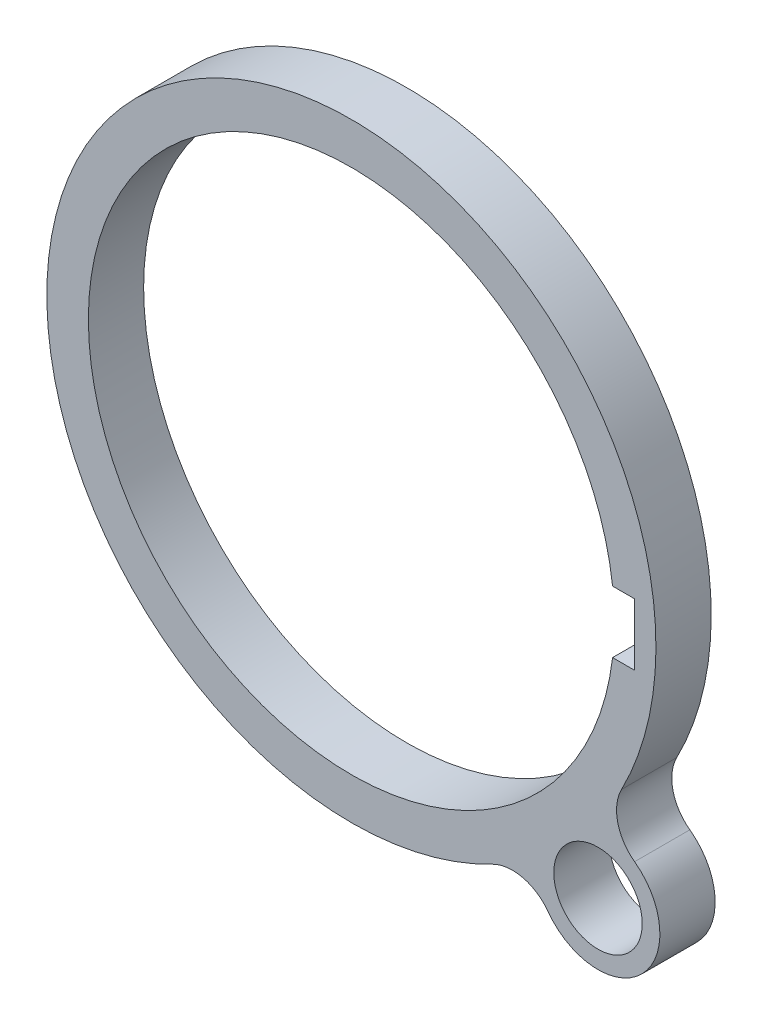
ISO-10303-21;
HEADER;
FILE_DESCRIPTION(('STEP AP214'),'2;1');
FILE_NAME('part.step','',(''),(''),'','','');
FILE_SCHEMA(('AUTOMOTIVE_DESIGN { 1 0 10303 214 1 1 1 1 }'));
ENDSEC;
DATA;
#1=APPLICATION_CONTEXT('core data for automotive mechanical design processes');
#2=APPLICATION_PROTOCOL_DEFINITION('international standard','automotive_design',2000,#1);
#3=PRODUCT_CONTEXT('',#1,'mechanical');
#4=PRODUCT('Part','Part','',(#3));
#5=PRODUCT_RELATED_PRODUCT_CATEGORY('part','',(#4));
#6=PRODUCT_DEFINITION_FORMATION('','',#4);
#7=PRODUCT_DEFINITION_CONTEXT('part definition',#1,'design');
#8=PRODUCT_DEFINITION('design','',#6,#7);
#9=PRODUCT_DEFINITION_SHAPE('','',#8);
#10=(LENGTH_UNIT() NAMED_UNIT(*) SI_UNIT(.MILLI.,.METRE.));
#11=(NAMED_UNIT(*) PLANE_ANGLE_UNIT() SI_UNIT($,.RADIAN.));
#12=(NAMED_UNIT(*) SI_UNIT($,.STERADIAN.) SOLID_ANGLE_UNIT());
#13=UNCERTAINTY_MEASURE_WITH_UNIT(LENGTH_MEASURE(1.E-05),#10,'distance_accuracy_value','');
#14=(GEOMETRIC_REPRESENTATION_CONTEXT(3) GLOBAL_UNCERTAINTY_ASSIGNED_CONTEXT((#13)) GLOBAL_UNIT_ASSIGNED_CONTEXT((#10,
#11,#12)) REPRESENTATION_CONTEXT('',''));
#15=CARTESIAN_POINT('',(0.,0.,0.));
#16=DIRECTION('',(0.,0.,1.));
#17=DIRECTION('',(1.,0.,0.));
#18=AXIS2_PLACEMENT_3D('',#15,#16,#17);
#19=CARTESIAN_POINT('',(0.,0.,-73.152));
#20=DIRECTION('',(0.,0.,1.));
#21=DIRECTION('',(1.,0.,0.));
#22=AXIS2_PLACEMENT_3D('',#19,#20,#21);
#23=CYLINDRICAL_SURFACE('',#22,15.113);
#24=DIRECTION('',(0.,0.,1.));
#25=VECTOR('',#24,1.);
#26=CARTESIAN_POINT('',(15.0080473413432,-1.778,-73.152));
#27=LINE('',#26,#25);
#28=CARTESIAN_POINT('',(15.0080473413432,-1.778,0.));
#29=VERTEX_POINT('',#28);
#30=CARTESIAN_POINT('',(15.0080473413432,-1.778,-3.175));
#31=VERTEX_POINT('',#30);
#32=EDGE_CURVE('E125',#29,#31,#27,.F.);
#33=ORIENTED_EDGE('',*,*,#32,.T.);
#34=CARTESIAN_POINT('',(0.,0.,-3.175));
#35=DIRECTION('',(0.,0.,1.));
#36=DIRECTION('',(1.,0.,0.));
#37=AXIS2_PLACEMENT_3D('',#34,#35,#36);
#38=CIRCLE('',#37,15.113);
#39=CARTESIAN_POINT('',(15.0080473413432,1.778,-3.175));
#40=VERTEX_POINT('',#39);
#41=EDGE_CURVE('E119',#31,#40,#38,.F.);
#42=ORIENTED_EDGE('',*,*,#41,.T.);
#43=DIRECTION('',(0.,0.,1.));
#44=VECTOR('',#43,1.);
#45=CARTESIAN_POINT('',(15.0080473413432,1.778,-73.152));
#46=LINE('',#45,#44);
#47=CARTESIAN_POINT('',(15.0080473413432,1.778,0.));
#48=VERTEX_POINT('',#47);
#49=EDGE_CURVE('E118',#40,#48,#46,.T.);
#50=ORIENTED_EDGE('',*,*,#49,.T.);
#51=CARTESIAN_POINT('',(0.,0.,0.));
#52=DIRECTION('',(0.,0.,1.));
#53=DIRECTION('',(1.,0.,0.));
#54=AXIS2_PLACEMENT_3D('',#51,#52,#53);
#55=CIRCLE('',#54,15.113);
#56=EDGE_CURVE('E136',#48,#29,#55,.T.);
#57=ORIENTED_EDGE('',*,*,#56,.T.);
#58=EDGE_LOOP('',(#33,#42,#50,#57));
#59=FACE_BOUND('',#58,.T.);
#60=ADVANCED_FACE('F35',(#59),#23,.F.);
#61=CARTESIAN_POINT('',(0.,0.,0.));
#62=DIRECTION('',(0.,0.,1.));
#63=DIRECTION('',(1.,0.,0.));
#64=AXIS2_PLACEMENT_3D('',#61,#62,#63);
#65=PLANE('',#64);
#66=CARTESIAN_POINT('',(0.,0.,0.));
#67=DIRECTION('',(0.,0.,-1.));
#68=DIRECTION('',(-1.,0.,0.));
#69=AXIS2_PLACEMENT_3D('',#66,#67,#68);
#70=CIRCLE('',#69,17.5);
#71=CARTESIAN_POINT('',(8.08146696242167,-15.5222386186815,0.));
#72=VERTEX_POINT('',#71);
#73=CARTESIAN_POINT('',(15.5222386186816,-8.08146696242151,0.));
#74=VERTEX_POINT('',#73);
#75=EDGE_CURVE('E110',#72,#74,#70,.T.);
#76=ORIENTED_EDGE('',*,*,#75,.F.);
#77=CARTESIAN_POINT('',(9.25443416725316,-17.7751806810501,0.));
#78=DIRECTION('',(0.,0.,1.));
#79=DIRECTION('',(1.,0.,0.));
#80=AXIS2_PLACEMENT_3D('',#77,#78,#79);
#81=CIRCLE('',#80,2.54);
#82=CARTESIAN_POINT('',(11.3027615538054,-16.2731970201869,0.));
#83=VERTEX_POINT('',#82);
#84=EDGE_CURVE('E149',#72,#83,#81,.F.);
#85=ORIENTED_EDGE('',*,*,#84,.T.);
#86=CARTESIAN_POINT('',(14.1704198949785,-14.1704198949783,0.));
#87=DIRECTION('',(0.,0.,1.));
#88=DIRECTION('',(1.,0.,0.));
#89=AXIS2_PLACEMENT_3D('',#86,#87,#88);
#90=CIRCLE('',#89,3.556);
#91=CARTESIAN_POINT('',(16.273197020187,-11.3027615538052,0.));
#92=VERTEX_POINT('',#91);
#93=EDGE_CURVE('E157',#92,#83,#90,.F.);
#94=ORIENTED_EDGE('',*,*,#93,.F.);
#95=CARTESIAN_POINT('',(17.7751806810502,-9.25443416725298,0.));
#96=DIRECTION('',(0.,0.,1.));
#97=DIRECTION('',(1.,0.,0.));
#98=AXIS2_PLACEMENT_3D('',#95,#96,#97);
#99=CIRCLE('',#98,2.54);
#100=EDGE_CURVE('E43',#92,#74,#99,.F.);
#101=ORIENTED_EDGE('',*,*,#100,.T.);
#102=EDGE_LOOP('',(#76,#85,#94,#101));
#103=FACE_BOUND('',#102,.T.);
#104=DIRECTION('',(-1.,0.,0.));
#105=VECTOR('',#104,1.);
#106=CARTESIAN_POINT('',(12.7,1.778,0.));
#107=LINE('',#106,#105);
#108=CARTESIAN_POINT('',(16.256,1.778,0.));
#109=VERTEX_POINT('',#108);
#110=EDGE_CURVE('E130',#109,#48,#107,.T.);
#111=ORIENTED_EDGE('',*,*,#110,.F.);
#112=DIRECTION('',(0.,1.,0.));
#113=VECTOR('',#112,1.);
#114=CARTESIAN_POINT('',(16.256,1.778,0.));
#115=LINE('',#114,#113);
#116=CARTESIAN_POINT('',(16.256,-1.778,0.));
#117=VERTEX_POINT('',#116);
#118=EDGE_CURVE('E123',#117,#109,#115,.T.);
#119=ORIENTED_EDGE('',*,*,#118,.F.);
#120=DIRECTION('',(1.,0.,0.));
#121=VECTOR('',#120,1.);
#122=CARTESIAN_POINT('',(16.256,-1.778,0.));
#123=LINE('',#122,#121);
#124=EDGE_CURVE('E182',#29,#117,#123,.T.);
#125=ORIENTED_EDGE('',*,*,#124,.F.);
#126=ORIENTED_EDGE('',*,*,#56,.F.);
#127=EDGE_LOOP('',(#111,#119,#125,#126));
#128=FACE_BOUND('',#127,.T.);
#129=CARTESIAN_POINT('',(14.1704198949785,-14.1704198949783,0.));
#130=DIRECTION('',(0.,0.,1.));
#131=DIRECTION('',(1.,0.,0.));
#132=AXIS2_PLACEMENT_3D('',#129,#130,#131);
#133=CIRCLE('',#132,2.54);
#134=CARTESIAN_POINT('',(16.7104198949785,-14.1704198949783,0.));
#135=VERTEX_POINT('',#134);
#136=EDGE_CURVE('E170',#135,#135,#133,.F.);
#137=ORIENTED_EDGE('',*,*,#136,.T.);
#138=EDGE_LOOP('',(#137));
#139=FACE_BOUND('',#138,.T.);
#140=ADVANCED_FACE('F153',(#103,#128,#139),#65,.T.);
#141=CARTESIAN_POINT('',(0.,0.,-101.6));
#142=DIRECTION('',(0.,0.,-1.));
#143=DIRECTION('',(-1.,0.,0.));
#144=AXIS2_PLACEMENT_3D('',#141,#142,#143);
#145=CYLINDRICAL_SURFACE('',#144,17.5);
#146=CARTESIAN_POINT('',(0.,0.,-3.175));
#147=DIRECTION('',(0.,0.,1.));
#148=DIRECTION('',(1.,0.,0.));
#149=AXIS2_PLACEMENT_3D('',#146,#147,#148);
#150=CIRCLE('',#149,17.5);
#151=CARTESIAN_POINT('',(8.08146696242167,-15.5222386186815,-3.175));
#152=VERTEX_POINT('',#151);
#153=CARTESIAN_POINT('',(15.5222386186816,-8.08146696242151,-3.175));
#154=VERTEX_POINT('',#153);
#155=EDGE_CURVE('E166',#152,#154,#150,.F.);
#156=ORIENTED_EDGE('',*,*,#155,.F.);
#157=DIRECTION('',(0.,0.,-1.));
#158=VECTOR('',#157,1.);
#159=CARTESIAN_POINT('',(8.08146696242168,-15.5222386186815,-101.6));
#160=LINE('',#159,#158);
#161=EDGE_CURVE('E146',#152,#72,#160,.F.);
#162=ORIENTED_EDGE('',*,*,#161,.T.);
#163=ORIENTED_EDGE('',*,*,#75,.T.);
#164=DIRECTION('',(0.,0.,-1.));
#165=VECTOR('',#164,1.);
#166=CARTESIAN_POINT('',(15.5222386186816,-8.08146696242151,-101.6));
#167=LINE('',#166,#165);
#168=EDGE_CURVE('E50',#74,#154,#167,.T.);
#169=ORIENTED_EDGE('',*,*,#168,.T.);
#170=EDGE_LOOP('',(#156,#162,#163,#169));
#171=FACE_BOUND('',#170,.T.);
#172=ADVANCED_FACE('F160',(#171),#145,.T.);
#173=CARTESIAN_POINT('',(12.7,1.778,-19.812));
#174=DIRECTION('',(0.,1.,0.));
#175=DIRECTION('',(0.,0.,1.));
#176=AXIS2_PLACEMENT_3D('',#173,#174,#175);
#177=PLANE('',#176);
#178=ORIENTED_EDGE('',*,*,#49,.F.);
#179=DIRECTION('',(1.,0.,0.));
#180=VECTOR('',#179,1.);
#181=CARTESIAN_POINT('',(12.7,1.778,-3.175));
#182=LINE('',#181,#180);
#183=CARTESIAN_POINT('',(16.256,1.778,-3.175));
#184=VERTEX_POINT('',#183);
#185=EDGE_CURVE('E102',#40,#184,#182,.T.);
#186=ORIENTED_EDGE('',*,*,#185,.T.);
#187=DIRECTION('',(0.,0.,1.));
#188=VECTOR('',#187,1.);
#189=CARTESIAN_POINT('',(16.256,1.778,-19.812));
#190=LINE('',#189,#188);
#191=EDGE_CURVE('E116',#184,#109,#190,.T.);
#192=ORIENTED_EDGE('',*,*,#191,.T.);
#193=ORIENTED_EDGE('',*,*,#110,.T.);
#194=EDGE_LOOP('',(#178,#186,#192,#193));
#195=FACE_BOUND('',#194,.T.);
#196=ADVANCED_FACE('F114',(#195),#177,.F.);
#197=CARTESIAN_POINT('',(16.256,-1.778,-19.812));
#198=DIRECTION('',(0.,-1.,0.));
#199=DIRECTION('',(1.,0.,0.));
#200=AXIS2_PLACEMENT_3D('',#197,#198,#199);
#201=PLANE('',#200);
#202=DIRECTION('',(0.,0.,1.));
#203=VECTOR('',#202,1.);
#204=CARTESIAN_POINT('',(16.256,-1.778,-19.812));
#205=LINE('',#204,#203);
#206=CARTESIAN_POINT('',(16.256,-1.778,-3.175));
#207=VERTEX_POINT('',#206);
#208=EDGE_CURVE('E126',#207,#117,#205,.T.);
#209=ORIENTED_EDGE('',*,*,#208,.F.);
#210=DIRECTION('',(-1.,0.,0.));
#211=VECTOR('',#210,1.);
#212=CARTESIAN_POINT('',(16.256,-1.778,-3.175));
#213=LINE('',#212,#211);
#214=EDGE_CURVE('E105',#207,#31,#213,.T.);
#215=ORIENTED_EDGE('',*,*,#214,.T.);
#216=ORIENTED_EDGE('',*,*,#32,.F.);
#217=ORIENTED_EDGE('',*,*,#124,.T.);
#218=EDGE_LOOP('',(#209,#215,#216,#217));
#219=FACE_BOUND('',#218,.T.);
#220=ADVANCED_FACE('F189',(#219),#201,.F.);
#221=CARTESIAN_POINT('',(16.256,1.778,-19.812));
#222=DIRECTION('',(1.,0.,0.));
#223=DIRECTION('',(0.,0.,-1.));
#224=AXIS2_PLACEMENT_3D('',#221,#222,#223);
#225=PLANE('',#224);
#226=ORIENTED_EDGE('',*,*,#191,.F.);
#227=DIRECTION('',(0.,-1.,0.));
#228=VECTOR('',#227,1.);
#229=CARTESIAN_POINT('',(16.256,1.778,-3.175));
#230=LINE('',#229,#228);
#231=EDGE_CURVE('E99',#184,#207,#230,.T.);
#232=ORIENTED_EDGE('',*,*,#231,.T.);
#233=ORIENTED_EDGE('',*,*,#208,.T.);
#234=ORIENTED_EDGE('',*,*,#118,.T.);
#235=EDGE_LOOP('',(#226,#232,#233,#234));
#236=FACE_BOUND('',#235,.T.);
#237=ADVANCED_FACE('F121',(#236),#225,.F.);
#238=CARTESIAN_POINT('',(0.,0.,-3.175));
#239=DIRECTION('',(0.,0.,1.));
#240=DIRECTION('',(1.,0.,0.));
#241=AXIS2_PLACEMENT_3D('',#238,#239,#240);
#242=PLANE('',#241);
#243=ORIENTED_EDGE('',*,*,#155,.T.);
#244=CARTESIAN_POINT('',(17.7751806810502,-9.25443416725298,-3.175));
#245=DIRECTION('',(0.,0.,1.));
#246=DIRECTION('',(1.,0.,0.));
#247=AXIS2_PLACEMENT_3D('',#244,#245,#246);
#248=CIRCLE('',#247,2.54);
#249=CARTESIAN_POINT('',(16.273197020187,-11.3027615538052,-3.175));
#250=VERTEX_POINT('',#249);
#251=EDGE_CURVE('E12',#154,#250,#248,.T.);
#252=ORIENTED_EDGE('',*,*,#251,.T.);
#253=CARTESIAN_POINT('',(14.1704198949785,-14.1704198949783,-3.175));
#254=DIRECTION('',(0.,0.,-1.));
#255=DIRECTION('',(-1.,0.,0.));
#256=AXIS2_PLACEMENT_3D('',#253,#254,#255);
#257=CIRCLE('',#256,3.556);
#258=CARTESIAN_POINT('',(11.3027615538054,-16.2731970201869,-3.175));
#259=VERTEX_POINT('',#258);
#260=EDGE_CURVE('E165',#250,#259,#257,.T.);
#261=ORIENTED_EDGE('',*,*,#260,.T.);
#262=CARTESIAN_POINT('',(9.25443416725316,-17.7751806810501,-3.175));
#263=DIRECTION('',(0.,0.,1.));
#264=DIRECTION('',(1.,0.,0.));
#265=AXIS2_PLACEMENT_3D('',#262,#263,#264);
#266=CIRCLE('',#265,2.54);
#267=EDGE_CURVE('E57',#259,#152,#266,.T.);
#268=ORIENTED_EDGE('',*,*,#267,.T.);
#269=EDGE_LOOP('',(#243,#252,#261,#268));
#270=FACE_BOUND('',#269,.T.);
#271=CARTESIAN_POINT('',(14.1704198949785,-14.1704198949783,-3.175));
#272=DIRECTION('',(0.,0.,-1.));
#273=DIRECTION('',(-1.,0.,0.));
#274=AXIS2_PLACEMENT_3D('',#271,#272,#273);
#275=CIRCLE('',#274,2.54);
#276=CARTESIAN_POINT('',(11.6304198949785,-14.1704198949783,-3.175));
#277=VERTEX_POINT('',#276);
#278=EDGE_CURVE('E171',#277,#277,#275,.T.);
#279=ORIENTED_EDGE('',*,*,#278,.F.);
#280=EDGE_LOOP('',(#279));
#281=FACE_BOUND('',#280,.T.);
#282=ORIENTED_EDGE('',*,*,#214,.F.);
#283=ORIENTED_EDGE('',*,*,#231,.F.);
#284=ORIENTED_EDGE('',*,*,#185,.F.);
#285=ORIENTED_EDGE('',*,*,#41,.F.);
#286=EDGE_LOOP('',(#282,#283,#284,#285));
#287=FACE_BOUND('',#286,.T.);
#288=ADVANCED_FACE('F101',(#270,#281,#287),#242,.F.);
#289=CARTESIAN_POINT('',(14.1704198949785,-14.1704198949783,10.0578868555975));
#290=DIRECTION('',(0.,0.,-1.));
#291=DIRECTION('',(-1.,0.,0.));
#292=AXIS2_PLACEMENT_3D('',#289,#290,#291);
#293=CYLINDRICAL_SURFACE('',#292,3.556);
#294=ORIENTED_EDGE('',*,*,#93,.T.);
#295=DIRECTION('',(0.,0.,-1.));
#296=VECTOR('',#295,1.);
#297=CARTESIAN_POINT('',(11.3027615538054,-16.2731970201869,10.0578868555975));
#298=LINE('',#297,#296);
#299=EDGE_CURVE('E142',#83,#259,#298,.T.);
#300=ORIENTED_EDGE('',*,*,#299,.T.);
#301=ORIENTED_EDGE('',*,*,#260,.F.);
#302=DIRECTION('',(0.,0.,-1.));
#303=VECTOR('',#302,1.);
#304=CARTESIAN_POINT('',(16.273197020187,-11.3027615538052,10.0578868555975));
#305=LINE('',#304,#303);
#306=EDGE_CURVE('E109',#250,#92,#305,.F.);
#307=ORIENTED_EDGE('',*,*,#306,.T.);
#308=EDGE_LOOP('',(#294,#300,#301,#307));
#309=FACE_BOUND('',#308,.T.);
#310=ADVANCED_FACE('F168',(#309),#293,.T.);
#311=CARTESIAN_POINT('',(14.1704198949785,-14.1704198949783,10.0578868555975));
#312=DIRECTION('',(0.,0.,-1.));
#313=DIRECTION('',(-1.,0.,0.));
#314=AXIS2_PLACEMENT_3D('',#311,#312,#313);
#315=CYLINDRICAL_SURFACE('',#314,2.54);
#316=ORIENTED_EDGE('',*,*,#278,.T.);
#317=EDGE_LOOP('',(#316));
#318=FACE_BOUND('',#317,.T.);
#319=ORIENTED_EDGE('',*,*,#136,.F.);
#320=EDGE_LOOP('',(#319));
#321=FACE_BOUND('',#320,.T.);
#322=ADVANCED_FACE('F208',(#318,#321),#315,.F.);
#323=CARTESIAN_POINT('',(9.25443416725317,-17.7751806810501,-101.6));
#324=DIRECTION('',(0.,0.,1.));
#325=DIRECTION('',(1.,0.,0.));
#326=AXIS2_PLACEMENT_3D('',#323,#324,#325);
#327=CYLINDRICAL_SURFACE('',#326,2.54);
#328=ORIENTED_EDGE('',*,*,#84,.F.);
#329=ORIENTED_EDGE('',*,*,#161,.F.);
#330=ORIENTED_EDGE('',*,*,#267,.F.);
#331=ORIENTED_EDGE('',*,*,#299,.F.);
#332=EDGE_LOOP('',(#328,#329,#330,#331));
#333=FACE_BOUND('',#332,.T.);
#334=ADVANCED_FACE('F206',(#333),#327,.F.);
#335=CARTESIAN_POINT('',(17.7751806810502,-9.25443416725298,-101.6));
#336=DIRECTION('',(0.,0.,-1.));
#337=DIRECTION('',(-1.,0.,0.));
#338=AXIS2_PLACEMENT_3D('',#335,#336,#337);
#339=CYLINDRICAL_SURFACE('',#338,2.54);
#340=ORIENTED_EDGE('',*,*,#251,.F.);
#341=ORIENTED_EDGE('',*,*,#168,.F.);
#342=ORIENTED_EDGE('',*,*,#100,.F.);
#343=ORIENTED_EDGE('',*,*,#306,.F.);
#344=EDGE_LOOP('',(#340,#341,#342,#343));
#345=FACE_BOUND('',#344,.T.);
#346=ADVANCED_FACE('F37',(#345),#339,.F.);
#347=CLOSED_SHELL('',(#60,#140,#172,#196,#220,#237,#288,#310,#322,#334,#346));
#348=MANIFOLD_SOLID_BREP('B2',#347);
#349=ADVANCED_BREP_SHAPE_REPRESENTATION('',(#18,#348),#14);
#350=SHAPE_DEFINITION_REPRESENTATION(#9,#349);
ENDSEC;
END-ISO-10303-21;
